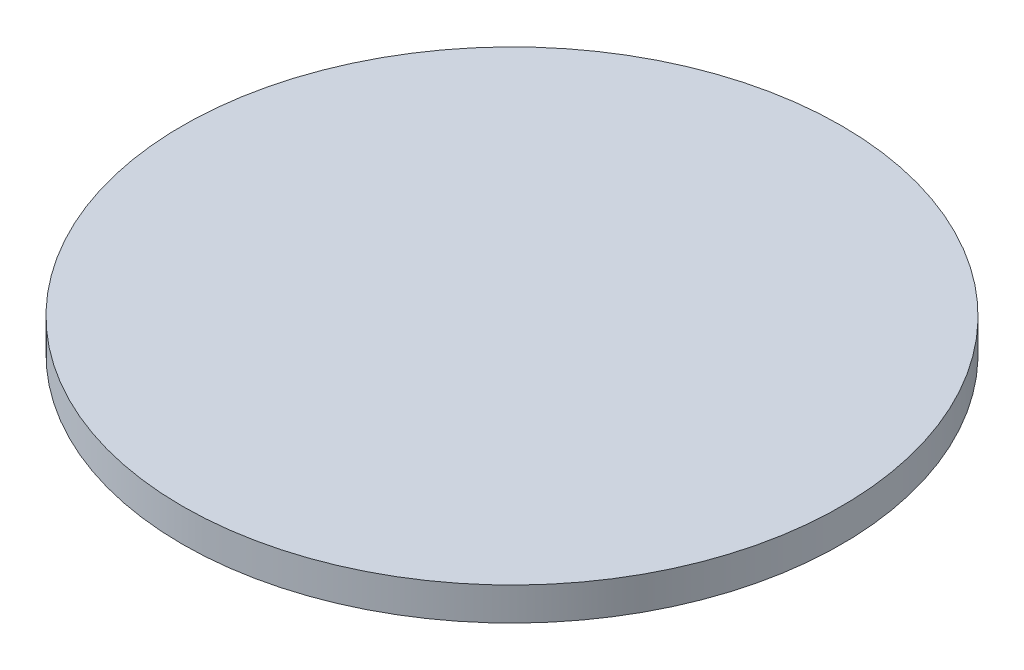
ISO-10303-21;
HEADER;
FILE_DESCRIPTION(('STEP AP214'),'2;1');
FILE_NAME('part.step','',(''),(''),'','','');
FILE_SCHEMA(('AUTOMOTIVE_DESIGN { 1 0 10303 214 1 1 1 1 }'));
ENDSEC;
DATA;
#1=APPLICATION_CONTEXT('core data for automotive mechanical design processes');
#2=APPLICATION_PROTOCOL_DEFINITION('international standard','automotive_design',2000,#1);
#3=PRODUCT_CONTEXT('',#1,'mechanical');
#4=PRODUCT('Part','Part','',(#3));
#5=PRODUCT_RELATED_PRODUCT_CATEGORY('part','',(#4));
#6=PRODUCT_DEFINITION_FORMATION('','',#4);
#7=PRODUCT_DEFINITION_CONTEXT('part definition',#1,'design');
#8=PRODUCT_DEFINITION('design','',#6,#7);
#9=PRODUCT_DEFINITION_SHAPE('','',#8);
#10=(LENGTH_UNIT() NAMED_UNIT(*) SI_UNIT(.MILLI.,.METRE.));
#11=(NAMED_UNIT(*) PLANE_ANGLE_UNIT() SI_UNIT($,.RADIAN.));
#12=(NAMED_UNIT(*) SI_UNIT($,.STERADIAN.) SOLID_ANGLE_UNIT());
#13=UNCERTAINTY_MEASURE_WITH_UNIT(LENGTH_MEASURE(1.E-05),#10,'distance_accuracy_value','');
#14=(GEOMETRIC_REPRESENTATION_CONTEXT(3) GLOBAL_UNCERTAINTY_ASSIGNED_CONTEXT((#13)) GLOBAL_UNIT_ASSIGNED_CONTEXT((#10,
#11,#12)) REPRESENTATION_CONTEXT('',''));
#15=CARTESIAN_POINT('',(0.,0.,0.));
#16=DIRECTION('',(0.,0.,1.));
#17=DIRECTION('',(1.,0.,0.));
#18=AXIS2_PLACEMENT_3D('',#15,#16,#17);
#19=CARTESIAN_POINT('',(0.,1.25,0.));
#20=DIRECTION('',(0.,-1.,0.));
#21=DIRECTION('',(0.,0.,-1.));
#22=AXIS2_PLACEMENT_3D('',#19,#20,#21);
#23=CYLINDRICAL_SURFACE('',#22,12.5);
#24=CARTESIAN_POINT('',(0.,1.25,0.));
#25=DIRECTION('',(0.,1.,0.));
#26=DIRECTION('',(0.,0.,1.));
#27=AXIS2_PLACEMENT_3D('',#24,#25,#26);
#28=CIRCLE('',#27,12.5);
#29=CARTESIAN_POINT('',(0.,1.25,12.5));
#30=VERTEX_POINT('',#29);
#31=EDGE_CURVE('E10',#30,#30,#28,.T.);
#32=ORIENTED_EDGE('',*,*,#31,.F.);
#33=EDGE_LOOP('',(#32));
#34=FACE_BOUND('',#33,.T.);
#35=CARTESIAN_POINT('',(0.,0.,0.));
#36=DIRECTION('',(0.,1.,0.));
#37=DIRECTION('',(0.,0.,1.));
#38=AXIS2_PLACEMENT_3D('',#35,#36,#37);
#39=CIRCLE('',#38,12.5);
#40=CARTESIAN_POINT('',(0.,0.,12.5));
#41=VERTEX_POINT('',#40);
#42=EDGE_CURVE('E36',#41,#41,#39,.T.);
#43=ORIENTED_EDGE('',*,*,#42,.T.);
#44=EDGE_LOOP('',(#43));
#45=FACE_BOUND('',#44,.T.);
#46=ADVANCED_FACE('F33',(#34,#45),#23,.T.);
#47=CARTESIAN_POINT('',(0.,1.25,0.));
#48=DIRECTION('',(0.,1.,0.));
#49=DIRECTION('',(0.,0.,1.));
#50=AXIS2_PLACEMENT_3D('',#47,#48,#49);
#51=PLANE('',#50);
#52=ORIENTED_EDGE('',*,*,#31,.T.);
#53=EDGE_LOOP('',(#52));
#54=FACE_BOUND('',#53,.T.);
#55=ADVANCED_FACE('F48',(#54),#51,.T.);
#56=CARTESIAN_POINT('',(0.,0.,0.));
#57=DIRECTION('',(0.,1.,0.));
#58=DIRECTION('',(0.,0.,1.));
#59=AXIS2_PLACEMENT_3D('',#56,#57,#58);
#60=PLANE('',#59);
#61=ORIENTED_EDGE('',*,*,#42,.F.);
#62=EDGE_LOOP('',(#61));
#63=FACE_BOUND('',#62,.T.);
#64=ADVANCED_FACE('F46',(#63),#60,.F.);
#65=CLOSED_SHELL('',(#46,#55,#64));
#66=MANIFOLD_SOLID_BREP('B2',#65);
#67=ADVANCED_BREP_SHAPE_REPRESENTATION('',(#18,#66),#14);
#68=SHAPE_DEFINITION_REPRESENTATION(#9,#67);
ENDSEC;
END-ISO-10303-21;
